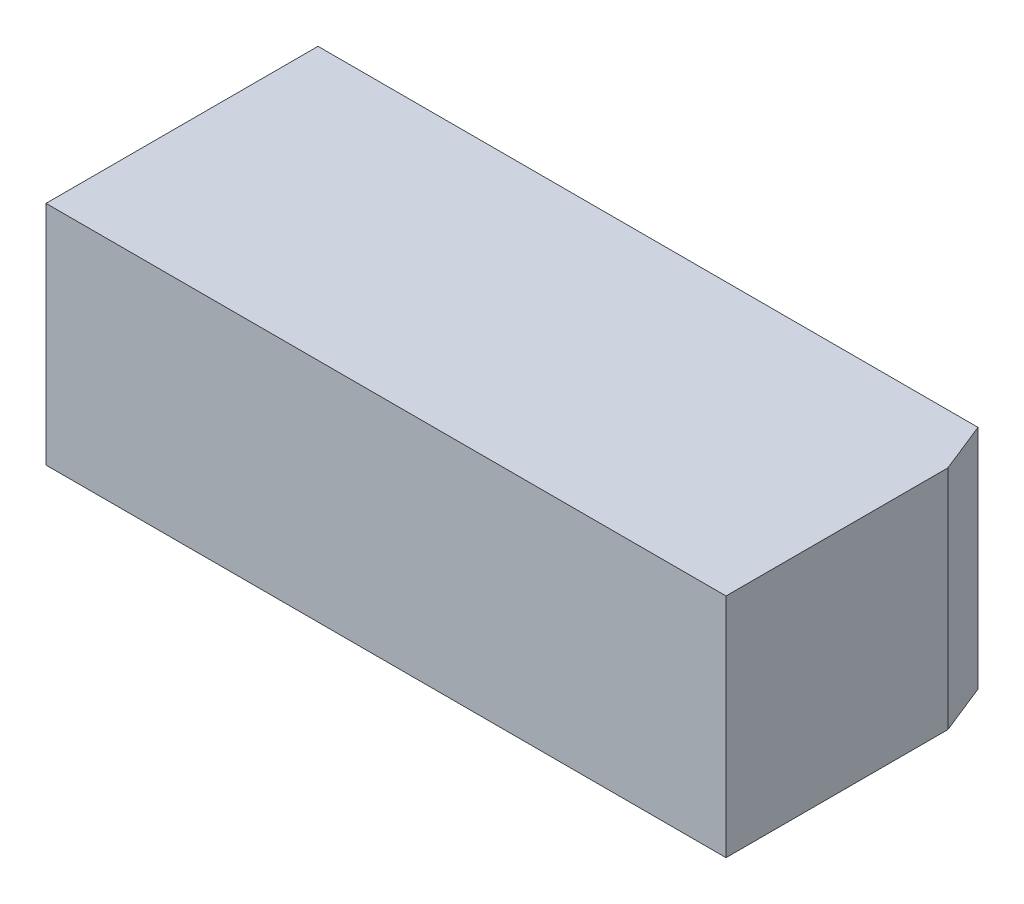
ISO-10303-21;
HEADER;
FILE_DESCRIPTION(('STEP AP214'),'2;1');
FILE_NAME('part.step','',(''),(''),'','','');
FILE_SCHEMA(('AUTOMOTIVE_DESIGN { 1 0 10303 214 1 1 1 1 }'));
ENDSEC;
DATA;
#1=APPLICATION_CONTEXT('core data for automotive mechanical design processes');
#2=APPLICATION_PROTOCOL_DEFINITION('international standard','automotive_design',2000,#1);
#3=PRODUCT_CONTEXT('',#1,'mechanical');
#4=PRODUCT('Part','Part','',(#3));
#5=PRODUCT_RELATED_PRODUCT_CATEGORY('part','',(#4));
#6=PRODUCT_DEFINITION_FORMATION('','',#4);
#7=PRODUCT_DEFINITION_CONTEXT('part definition',#1,'design');
#8=PRODUCT_DEFINITION('design','',#6,#7);
#9=PRODUCT_DEFINITION_SHAPE('','',#8);
#10=(LENGTH_UNIT() NAMED_UNIT(*) SI_UNIT(.MILLI.,.METRE.));
#11=(NAMED_UNIT(*) PLANE_ANGLE_UNIT() SI_UNIT($,.RADIAN.));
#12=(NAMED_UNIT(*) SI_UNIT($,.STERADIAN.) SOLID_ANGLE_UNIT());
#13=UNCERTAINTY_MEASURE_WITH_UNIT(LENGTH_MEASURE(1.E-05),#10,'distance_accuracy_value','');
#14=(GEOMETRIC_REPRESENTATION_CONTEXT(3) GLOBAL_UNCERTAINTY_ASSIGNED_CONTEXT((#13)) GLOBAL_UNIT_ASSIGNED_CONTEXT((#10,
#11,#12)) REPRESENTATION_CONTEXT('',''));
#15=CARTESIAN_POINT('',(0.,0.,0.));
#16=DIRECTION('',(0.,0.,1.));
#17=DIRECTION('',(1.,0.,0.));
#18=AXIS2_PLACEMENT_3D('',#15,#16,#17);
#19=CARTESIAN_POINT('',(-7.5,5.,-3.));
#20=DIRECTION('',(1.,0.,0.));
#21=DIRECTION('',(0.,0.,-1.));
#22=AXIS2_PLACEMENT_3D('',#19,#20,#21);
#23=PLANE('',#22);
#24=DIRECTION('',(0.,0.,1.));
#25=VECTOR('',#24,1.);
#26=CARTESIAN_POINT('',(-7.5,0.,-3.));
#27=LINE('',#26,#25);
#28=CARTESIAN_POINT('',(-7.5,0.,-3.));
#29=VERTEX_POINT('',#28);
#30=CARTESIAN_POINT('',(-7.5,0.,3.));
#31=VERTEX_POINT('',#30);
#32=EDGE_CURVE('E109',#29,#31,#27,.T.);
#33=ORIENTED_EDGE('',*,*,#32,.T.);
#34=DIRECTION('',(0.,-1.,0.));
#35=VECTOR('',#34,1.);
#36=CARTESIAN_POINT('',(-7.5,5.,3.));
#37=LINE('',#36,#35);
#38=CARTESIAN_POINT('',(-7.5,5.,3.));
#39=VERTEX_POINT('',#38);
#40=EDGE_CURVE('E11',#39,#31,#37,.T.);
#41=ORIENTED_EDGE('',*,*,#40,.F.);
#42=DIRECTION('',(0.,0.,1.));
#43=VECTOR('',#42,1.);
#44=CARTESIAN_POINT('',(-7.5,5.,-3.));
#45=LINE('',#44,#43);
#46=CARTESIAN_POINT('',(-7.5,5.,-3.));
#47=VERTEX_POINT('',#46);
#48=EDGE_CURVE('E105',#47,#39,#45,.T.);
#49=ORIENTED_EDGE('',*,*,#48,.F.);
#50=DIRECTION('',(0.,-1.,0.));
#51=VECTOR('',#50,1.);
#52=CARTESIAN_POINT('',(-7.5,5.,-3.));
#53=LINE('',#52,#51);
#54=EDGE_CURVE('E103',#47,#29,#53,.T.);
#55=ORIENTED_EDGE('',*,*,#54,.T.);
#56=EDGE_LOOP('',(#33,#41,#49,#55));
#57=FACE_BOUND('',#56,.T.);
#58=ADVANCED_FACE('F33',(#57),#23,.F.);
#59=CARTESIAN_POINT('',(7.5,5.,3.));
#60=DIRECTION('',(0.,0.,-1.));
#61=DIRECTION('',(-1.,0.,0.));
#62=AXIS2_PLACEMENT_3D('',#59,#60,#61);
#63=PLANE('',#62);
#64=DIRECTION('',(1.,0.,0.));
#65=VECTOR('',#64,1.);
#66=CARTESIAN_POINT('',(7.5,0.,3.));
#67=LINE('',#66,#65);
#68=CARTESIAN_POINT('',(7.5,0.,3.));
#69=VERTEX_POINT('',#68);
#70=EDGE_CURVE('E112',#31,#69,#67,.T.);
#71=ORIENTED_EDGE('',*,*,#70,.T.);
#72=DIRECTION('',(0.,-1.,0.));
#73=VECTOR('',#72,1.);
#74=CARTESIAN_POINT('',(7.5,5.,3.));
#75=LINE('',#74,#73);
#76=CARTESIAN_POINT('',(7.5,5.,3.));
#77=VERTEX_POINT('',#76);
#78=EDGE_CURVE('E40',#77,#69,#75,.T.);
#79=ORIENTED_EDGE('',*,*,#78,.F.);
#80=DIRECTION('',(1.,0.,0.));
#81=VECTOR('',#80,1.);
#82=CARTESIAN_POINT('',(7.5,5.,3.));
#83=LINE('',#82,#81);
#84=EDGE_CURVE('E79',#39,#77,#83,.T.);
#85=ORIENTED_EDGE('',*,*,#84,.F.);
#86=ORIENTED_EDGE('',*,*,#40,.T.);
#87=EDGE_LOOP('',(#71,#79,#85,#86));
#88=FACE_BOUND('',#87,.T.);
#89=ADVANCED_FACE('F149',(#88),#63,.F.);
#90=CARTESIAN_POINT('',(7.5,5.,-3.));
#91=DIRECTION('',(-1.,0.,0.));
#92=DIRECTION('',(0.,0.,1.));
#93=AXIS2_PLACEMENT_3D('',#90,#91,#92);
#94=PLANE('',#93);
#95=DIRECTION('',(0.,0.,-1.));
#96=VECTOR('',#95,1.);
#97=CARTESIAN_POINT('',(7.5,0.,-3.));
#98=LINE('',#97,#96);
#99=CARTESIAN_POINT('',(7.5,0.,-1.89511273784654));
#100=VERTEX_POINT('',#99);
#101=EDGE_CURVE('E99',#69,#100,#98,.T.);
#102=ORIENTED_EDGE('',*,*,#101,.T.);
#103=DIRECTION('',(0.,-1.,0.));
#104=VECTOR('',#103,1.);
#105=CARTESIAN_POINT('',(7.5,5.,-1.89511273784654));
#106=LINE('',#105,#104);
#107=CARTESIAN_POINT('',(7.5,5.,-1.89511273784654));
#108=VERTEX_POINT('',#107);
#109=EDGE_CURVE('E47',#108,#100,#106,.T.);
#110=ORIENTED_EDGE('',*,*,#109,.F.);
#111=DIRECTION('',(0.,0.,-1.));
#112=VECTOR('',#111,1.);
#113=CARTESIAN_POINT('',(7.5,5.,-3.));
#114=LINE('',#113,#112);
#115=EDGE_CURVE('E97',#77,#108,#114,.T.);
#116=ORIENTED_EDGE('',*,*,#115,.F.);
#117=ORIENTED_EDGE('',*,*,#78,.T.);
#118=EDGE_LOOP('',(#102,#110,#116,#117));
#119=FACE_BOUND('',#118,.T.);
#120=ADVANCED_FACE('F95',(#119),#94,.F.);
#121=CARTESIAN_POINT('',(7.5,5.,-3.));
#122=DIRECTION('',(0.,0.,1.));
#123=DIRECTION('',(1.,0.,0.));
#124=AXIS2_PLACEMENT_3D('',#121,#122,#123);
#125=PLANE('',#124);
#126=DIRECTION('',(-1.,0.,0.));
#127=VECTOR('',#126,1.);
#128=CARTESIAN_POINT('',(7.5,5.,-3.));
#129=LINE('',#128,#127);
#130=CARTESIAN_POINT('',(7.05804509513862,5.,-3.));
#131=VERTEX_POINT('',#130);
#132=EDGE_CURVE('E56',#131,#47,#129,.T.);
#133=ORIENTED_EDGE('',*,*,#132,.F.);
#134=DIRECTION('',(0.,-1.,0.));
#135=VECTOR('',#134,1.);
#136=CARTESIAN_POINT('',(7.05804509513862,5.,-3.));
#137=LINE('',#136,#135);
#138=CARTESIAN_POINT('',(7.05804509513862,0.,-3.));
#139=VERTEX_POINT('',#138);
#140=EDGE_CURVE('E88',#131,#139,#137,.T.);
#141=ORIENTED_EDGE('',*,*,#140,.T.);
#142=DIRECTION('',(-1.,0.,0.));
#143=VECTOR('',#142,1.);
#144=CARTESIAN_POINT('',(7.5,0.,-3.));
#145=LINE('',#144,#143);
#146=EDGE_CURVE('E74',#139,#29,#145,.T.);
#147=ORIENTED_EDGE('',*,*,#146,.T.);
#148=ORIENTED_EDGE('',*,*,#54,.F.);
#149=EDGE_LOOP('',(#133,#141,#147,#148));
#150=FACE_BOUND('',#149,.T.);
#151=ADVANCED_FACE('F155',(#150),#125,.F.);
#152=CARTESIAN_POINT('',(0.,5.,0.));
#153=DIRECTION('',(0.,-1.,0.));
#154=DIRECTION('',(0.,0.,-1.));
#155=AXIS2_PLACEMENT_3D('',#152,#153,#154);
#156=PLANE('',#155);
#157=ORIENTED_EDGE('',*,*,#115,.T.);
#158=DIRECTION('',(-0.371390676354104,0.,-0.928476690885259));
#159=VECTOR('',#158,1.);
#160=CARTESIAN_POINT('',(7.05804509513862,5.,-3.));
#161=LINE('',#160,#159);
#162=EDGE_CURVE('E86',#108,#131,#161,.T.);
#163=ORIENTED_EDGE('',*,*,#162,.T.);
#164=ORIENTED_EDGE('',*,*,#132,.T.);
#165=ORIENTED_EDGE('',*,*,#48,.T.);
#166=ORIENTED_EDGE('',*,*,#84,.T.);
#167=EDGE_LOOP('',(#157,#163,#164,#165,#166));
#168=FACE_BOUND('',#167,.T.);
#169=ADVANCED_FACE('F101',(#168),#156,.F.);
#170=CARTESIAN_POINT('',(0.,0.,0.));
#171=DIRECTION('',(0.,-1.,0.));
#172=DIRECTION('',(0.,0.,-1.));
#173=AXIS2_PLACEMENT_3D('',#170,#171,#172);
#174=PLANE('',#173);
#175=DIRECTION('',(-0.371390676354104,0.,-0.928476690885259));
#176=VECTOR('',#175,1.);
#177=CARTESIAN_POINT('',(7.05804509513862,0.,-3.));
#178=LINE('',#177,#176);
#179=EDGE_CURVE('E90',#100,#139,#178,.T.);
#180=ORIENTED_EDGE('',*,*,#179,.F.);
#181=ORIENTED_EDGE('',*,*,#101,.F.);
#182=ORIENTED_EDGE('',*,*,#70,.F.);
#183=ORIENTED_EDGE('',*,*,#32,.F.);
#184=ORIENTED_EDGE('',*,*,#146,.F.);
#185=EDGE_LOOP('',(#180,#181,#182,#183,#184));
#186=FACE_BOUND('',#185,.T.);
#187=CARTESIAN_POINT('',(2.5,0.,0.));
#188=DIRECTION('',(0.,-1.,0.));
#189=DIRECTION('',(0.,0.,-1.));
#190=AXIS2_PLACEMENT_3D('',#187,#188,#189);
#191=CIRCLE('',#190,0.795000000000002);
#192=CARTESIAN_POINT('',(2.5,0.,-0.795000000000001));
#193=VERTEX_POINT('',#192);
#194=EDGE_CURVE('E123',#193,#193,#191,.T.);
#195=ORIENTED_EDGE('',*,*,#194,.F.);
#196=EDGE_LOOP('',(#195));
#197=FACE_BOUND('',#196,.T.);
#198=CARTESIAN_POINT('',(-6.25,0.,1.875));
#199=DIRECTION('',(0.,-1.,0.));
#200=DIRECTION('',(0.,0.,-1.));
#201=AXIS2_PLACEMENT_3D('',#198,#199,#200);
#202=CIRCLE('',#201,0.795000000000002);
#203=CARTESIAN_POINT('',(-6.25,0.,1.08));
#204=VERTEX_POINT('',#203);
#205=EDGE_CURVE('E128',#204,#204,#202,.T.);
#206=ORIENTED_EDGE('',*,*,#205,.F.);
#207=EDGE_LOOP('',(#206));
#208=FACE_BOUND('',#207,.T.);
#209=CARTESIAN_POINT('',(-6.25,0.,-1.875));
#210=DIRECTION('',(0.,-1.,0.));
#211=DIRECTION('',(0.,0.,-1.));
#212=AXIS2_PLACEMENT_3D('',#209,#210,#211);
#213=CIRCLE('',#212,0.795000000000001);
#214=CARTESIAN_POINT('',(-6.25,0.,-2.67));
#215=VERTEX_POINT('',#214);
#216=EDGE_CURVE('E134',#215,#215,#213,.T.);
#217=ORIENTED_EDGE('',*,*,#216,.F.);
#218=EDGE_LOOP('',(#217));
#219=FACE_BOUND('',#218,.T.);
#220=CARTESIAN_POINT('',(-4.5,0.,0.));
#221=DIRECTION('',(0.,-1.,0.));
#222=DIRECTION('',(0.,0.,-1.));
#223=AXIS2_PLACEMENT_3D('',#220,#221,#222);
#224=CIRCLE('',#223,1.25);
#225=CARTESIAN_POINT('',(-4.5,0.,-1.25));
#226=VERTEX_POINT('',#225);
#227=EDGE_CURVE('E140',#226,#226,#224,.T.);
#228=ORIENTED_EDGE('',*,*,#227,.F.);
#229=EDGE_LOOP('',(#228));
#230=FACE_BOUND('',#229,.T.);
#231=ADVANCED_FACE('F118',(#186,#197,#208,#219,#230),#174,.T.);
#232=CARTESIAN_POINT('',(-4.5,4.,0.));
#233=DIRECTION('',(0.,-1.,0.));
#234=DIRECTION('',(0.,0.,-1.));
#235=AXIS2_PLACEMENT_3D('',#232,#233,#234);
#236=CYLINDRICAL_SURFACE('',#235,1.25);
#237=CARTESIAN_POINT('',(-4.5,4.,0.));
#238=DIRECTION('',(0.,-1.,0.));
#239=DIRECTION('',(0.,0.,-1.));
#240=AXIS2_PLACEMENT_3D('',#237,#238,#239);
#241=CIRCLE('',#240,1.25);
#242=CARTESIAN_POINT('',(-4.5,4.,-1.25));
#243=VERTEX_POINT('',#242);
#244=EDGE_CURVE('E113',#243,#243,#241,.T.);
#245=ORIENTED_EDGE('',*,*,#244,.F.);
#246=EDGE_LOOP('',(#245));
#247=FACE_BOUND('',#246,.T.);
#248=ORIENTED_EDGE('',*,*,#227,.T.);
#249=EDGE_LOOP('',(#248));
#250=FACE_BOUND('',#249,.T.);
#251=ADVANCED_FACE('F162',(#247,#250),#236,.F.);
#252=CARTESIAN_POINT('',(-4.5,4.,0.));
#253=DIRECTION('',(0.,-1.,0.));
#254=DIRECTION('',(0.,0.,-1.));
#255=AXIS2_PLACEMENT_3D('',#252,#253,#254);
#256=PLANE('',#255);
#257=ORIENTED_EDGE('',*,*,#244,.T.);
#258=EDGE_LOOP('',(#257));
#259=FACE_BOUND('',#258,.T.);
#260=ADVANCED_FACE('F167',(#259),#256,.T.);
#261=CARTESIAN_POINT('',(-6.25,1.,-1.875));
#262=DIRECTION('',(0.,-1.,0.));
#263=DIRECTION('',(0.,0.,-1.));
#264=AXIS2_PLACEMENT_3D('',#261,#262,#263);
#265=CYLINDRICAL_SURFACE('',#264,0.795000000000001);
#266=CARTESIAN_POINT('',(-6.25,1.,-1.875));
#267=DIRECTION('',(0.,-1.,0.));
#268=DIRECTION('',(0.,0.,-1.));
#269=AXIS2_PLACEMENT_3D('',#266,#267,#268);
#270=CIRCLE('',#269,0.795000000000001);
#271=CARTESIAN_POINT('',(-6.25,1.,-2.67));
#272=VERTEX_POINT('',#271);
#273=EDGE_CURVE('E137',#272,#272,#270,.T.);
#274=ORIENTED_EDGE('',*,*,#273,.F.);
#275=EDGE_LOOP('',(#274));
#276=FACE_BOUND('',#275,.T.);
#277=ORIENTED_EDGE('',*,*,#216,.T.);
#278=EDGE_LOOP('',(#277));
#279=FACE_BOUND('',#278,.T.);
#280=ADVANCED_FACE('F171',(#276,#279),#265,.F.);
#281=CARTESIAN_POINT('',(-6.25,1.,-1.875));
#282=DIRECTION('',(0.,-1.,0.));
#283=DIRECTION('',(0.,0.,-1.));
#284=AXIS2_PLACEMENT_3D('',#281,#282,#283);
#285=PLANE('',#284);
#286=ORIENTED_EDGE('',*,*,#273,.T.);
#287=EDGE_LOOP('',(#286));
#288=FACE_BOUND('',#287,.T.);
#289=ADVANCED_FACE('F175',(#288),#285,.T.);
#290=CARTESIAN_POINT('',(-6.25,1.,1.875));
#291=DIRECTION('',(0.,-1.,0.));
#292=DIRECTION('',(0.,0.,-1.));
#293=AXIS2_PLACEMENT_3D('',#290,#291,#292);
#294=CYLINDRICAL_SURFACE('',#293,0.795000000000002);
#295=CARTESIAN_POINT('',(-6.25,1.,1.875));
#296=DIRECTION('',(0.,-1.,0.));
#297=DIRECTION('',(0.,0.,-1.));
#298=AXIS2_PLACEMENT_3D('',#295,#296,#297);
#299=CIRCLE('',#298,0.795000000000002);
#300=CARTESIAN_POINT('',(-6.25,1.,1.08));
#301=VERTEX_POINT('',#300);
#302=EDGE_CURVE('E131',#301,#301,#299,.T.);
#303=ORIENTED_EDGE('',*,*,#302,.F.);
#304=EDGE_LOOP('',(#303));
#305=FACE_BOUND('',#304,.T.);
#306=ORIENTED_EDGE('',*,*,#205,.T.);
#307=EDGE_LOOP('',(#306));
#308=FACE_BOUND('',#307,.T.);
#309=ADVANCED_FACE('F179',(#305,#308),#294,.F.);
#310=CARTESIAN_POINT('',(-6.25,1.,1.875));
#311=DIRECTION('',(0.,-1.,0.));
#312=DIRECTION('',(0.,0.,-1.));
#313=AXIS2_PLACEMENT_3D('',#310,#311,#312);
#314=PLANE('',#313);
#315=ORIENTED_EDGE('',*,*,#302,.T.);
#316=EDGE_LOOP('',(#315));
#317=FACE_BOUND('',#316,.T.);
#318=ADVANCED_FACE('F183',(#317),#314,.T.);
#319=CARTESIAN_POINT('',(2.5,1.,0.));
#320=DIRECTION('',(0.,-1.,0.));
#321=DIRECTION('',(0.,0.,-1.));
#322=AXIS2_PLACEMENT_3D('',#319,#320,#321);
#323=CYLINDRICAL_SURFACE('',#322,0.795000000000002);
#324=CARTESIAN_POINT('',(2.5,1.,0.));
#325=DIRECTION('',(0.,-1.,0.));
#326=DIRECTION('',(0.,0.,-1.));
#327=AXIS2_PLACEMENT_3D('',#324,#325,#326);
#328=CIRCLE('',#327,0.795000000000002);
#329=CARTESIAN_POINT('',(2.5,1.,-0.795000000000001));
#330=VERTEX_POINT('',#329);
#331=EDGE_CURVE('E125',#330,#330,#328,.T.);
#332=ORIENTED_EDGE('',*,*,#331,.F.);
#333=EDGE_LOOP('',(#332));
#334=FACE_BOUND('',#333,.T.);
#335=ORIENTED_EDGE('',*,*,#194,.T.);
#336=EDGE_LOOP('',(#335));
#337=FACE_BOUND('',#336,.T.);
#338=ADVANCED_FACE('F187',(#334,#337),#323,.F.);
#339=CARTESIAN_POINT('',(2.5,1.,0.));
#340=DIRECTION('',(0.,-1.,0.));
#341=DIRECTION('',(0.,0.,-1.));
#342=AXIS2_PLACEMENT_3D('',#339,#340,#341);
#343=PLANE('',#342);
#344=ORIENTED_EDGE('',*,*,#331,.T.);
#345=EDGE_LOOP('',(#344));
#346=FACE_BOUND('',#345,.T.);
#347=ADVANCED_FACE('F191',(#346),#343,.T.);
#348=CARTESIAN_POINT('',(7.05804509513862,5.,-3.));
#349=DIRECTION('',(-0.928476690885259,0.,0.371390676354104));
#350=DIRECTION('',(0.371390676354104,0.,0.928476690885259));
#351=AXIS2_PLACEMENT_3D('',#348,#349,#350);
#352=PLANE('',#351);
#353=ORIENTED_EDGE('',*,*,#179,.T.);
#354=ORIENTED_EDGE('',*,*,#140,.F.);
#355=ORIENTED_EDGE('',*,*,#162,.F.);
#356=ORIENTED_EDGE('',*,*,#109,.T.);
#357=EDGE_LOOP('',(#353,#354,#355,#356));
#358=FACE_BOUND('',#357,.T.);
#359=ADVANCED_FACE('F87',(#358),#352,.F.);
#360=CLOSED_SHELL('',(#58,#89,#120,#151,#169,#231,#251,#260,#280,#289,#309,#318,#338,#347,#359));
#361=MANIFOLD_SOLID_BREP('B2',#360);
#362=ADVANCED_BREP_SHAPE_REPRESENTATION('',(#18,#361),#14);
#363=SHAPE_DEFINITION_REPRESENTATION(#9,#362);
ENDSEC;
END-ISO-10303-21;
